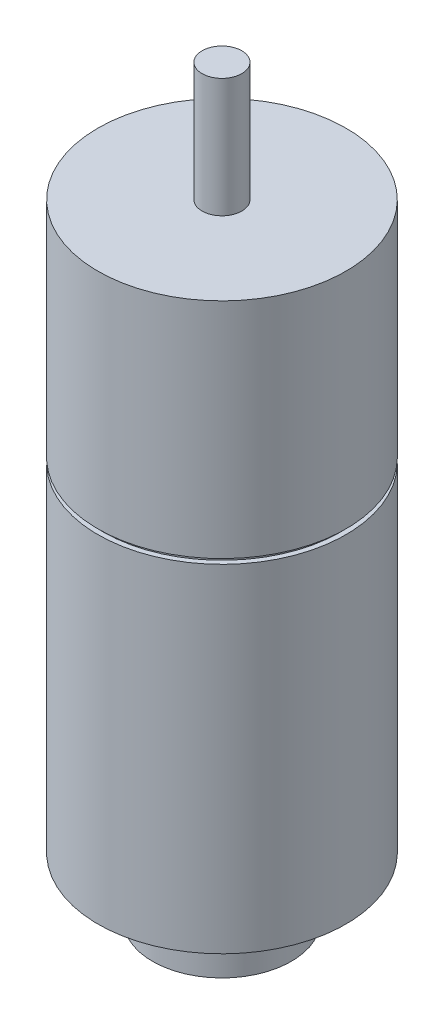
ISO-10303-21;
HEADER;
FILE_DESCRIPTION(('STEP AP214'),'2;1');
FILE_NAME('part.step','',(''),(''),'','','');
FILE_SCHEMA(('AUTOMOTIVE_DESIGN { 1 0 10303 214 1 1 1 1 }'));
ENDSEC;
DATA;
#1=APPLICATION_CONTEXT('core data for automotive mechanical design processes');
#2=APPLICATION_PROTOCOL_DEFINITION('international standard','automotive_design',2000,#1);
#3=PRODUCT_CONTEXT('',#1,'mechanical');
#4=PRODUCT('Part','Part','',(#3));
#5=PRODUCT_RELATED_PRODUCT_CATEGORY('part','',(#4));
#6=PRODUCT_DEFINITION_FORMATION('','',#4);
#7=PRODUCT_DEFINITION_CONTEXT('part definition',#1,'design');
#8=PRODUCT_DEFINITION('design','',#6,#7);
#9=PRODUCT_DEFINITION_SHAPE('','',#8);
#10=(LENGTH_UNIT() NAMED_UNIT(*) SI_UNIT(.MILLI.,.METRE.));
#11=(NAMED_UNIT(*) PLANE_ANGLE_UNIT() SI_UNIT($,.RADIAN.));
#12=(NAMED_UNIT(*) SI_UNIT($,.STERADIAN.) SOLID_ANGLE_UNIT());
#13=UNCERTAINTY_MEASURE_WITH_UNIT(LENGTH_MEASURE(1.E-05),#10,'distance_accuracy_value','');
#14=(GEOMETRIC_REPRESENTATION_CONTEXT(3) GLOBAL_UNCERTAINTY_ASSIGNED_CONTEXT((#13)) GLOBAL_UNIT_ASSIGNED_CONTEXT((#10,
#11,#12)) REPRESENTATION_CONTEXT('',''));
#15=CARTESIAN_POINT('',(0.,0.,0.));
#16=DIRECTION('',(0.,0.,1.));
#17=DIRECTION('',(1.,0.,0.));
#18=AXIS2_PLACEMENT_3D('',#15,#16,#17);
#19=CARTESIAN_POINT('',(0.,0.,0.));
#20=DIRECTION('',(0.,1.,0.));
#21=DIRECTION('',(-1.,0.,0.));
#22=AXIS2_PLACEMENT_3D('',#19,#20,#21);
#23=PLANE('',#22);
#24=CARTESIAN_POINT('',(0.,0.,0.));
#25=DIRECTION('',(0.,1.,0.));
#26=DIRECTION('',(-1.,0.,0.));
#27=AXIS2_PLACEMENT_3D('',#24,#25,#26);
#28=CIRCLE('',#27,7.00000000000001);
#29=CARTESIAN_POINT('',(-7.00000000000001,0.,0.));
#30=VERTEX_POINT('',#29);
#31=EDGE_CURVE('E10',#30,#30,#28,.T.);
#32=ORIENTED_EDGE('',*,*,#31,.F.);
#33=EDGE_LOOP('',(#32));
#34=FACE_BOUND('',#33,.T.);
#35=ADVANCED_FACE('F31',(#34),#23,.F.);
#36=CARTESIAN_POINT('',(0.,75.,0.));
#37=DIRECTION('',(0.,1.,0.));
#38=DIRECTION('',(-1.,0.,0.));
#39=AXIS2_PLACEMENT_3D('',#36,#37,#38);
#40=CYLINDRICAL_SURFACE('',#39,7.00000000000002);
#41=CARTESIAN_POINT('',(0.,5.,0.));
#42=DIRECTION('',(0.,1.,0.));
#43=DIRECTION('',(-1.,0.,0.));
#44=AXIS2_PLACEMENT_3D('',#41,#42,#43);
#45=CIRCLE('',#44,7.00000000000003);
#46=CARTESIAN_POINT('',(-7.00000000000003,5.,0.));
#47=VERTEX_POINT('',#46);
#48=EDGE_CURVE('E37',#47,#47,#45,.T.);
#49=ORIENTED_EDGE('',*,*,#48,.F.);
#50=EDGE_LOOP('',(#49));
#51=FACE_BOUND('',#50,.T.);
#52=ORIENTED_EDGE('',*,*,#31,.T.);
#53=EDGE_LOOP('',(#52));
#54=FACE_BOUND('',#53,.T.);
#55=ADVANCED_FACE('F133',(#51,#54),#40,.T.);
#56=CARTESIAN_POINT('',(7.00000000000003,5.,0.));
#57=DIRECTION('',(0.,-1.,0.));
#58=DIRECTION('',(1.,0.,0.));
#59=AXIS2_PLACEMENT_3D('',#56,#57,#58);
#60=PLANE('',#59);
#61=CARTESIAN_POINT('',(0.,5.,0.));
#62=DIRECTION('',(0.,1.,0.));
#63=DIRECTION('',(-1.,0.,0.));
#64=AXIS2_PLACEMENT_3D('',#61,#62,#63);
#65=CIRCLE('',#64,6.00000000000003);
#66=CARTESIAN_POINT('',(-6.00000000000003,5.,0.));
#67=VERTEX_POINT('',#66);
#68=EDGE_CURVE('E41',#67,#67,#65,.T.);
#69=ORIENTED_EDGE('',*,*,#68,.F.);
#70=EDGE_LOOP('',(#69));
#71=FACE_BOUND('',#70,.T.);
#72=ORIENTED_EDGE('',*,*,#48,.T.);
#73=EDGE_LOOP('',(#72));
#74=FACE_BOUND('',#73,.T.);
#75=ADVANCED_FACE('F128',(#71,#74),#60,.F.);
#76=CARTESIAN_POINT('',(0.,75.,0.));
#77=DIRECTION('',(0.,1.,0.));
#78=DIRECTION('',(-1.,0.,0.));
#79=AXIS2_PLACEMENT_3D('',#76,#77,#78);
#80=CYLINDRICAL_SURFACE('',#79,6.00000000000003);
#81=CARTESIAN_POINT('',(0.,5.99999999999999,0.));
#82=DIRECTION('',(0.,1.,0.));
#83=DIRECTION('',(-1.,0.,0.));
#84=AXIS2_PLACEMENT_3D('',#81,#82,#83);
#85=CIRCLE('',#84,6.00000000000003);
#86=CARTESIAN_POINT('',(-6.00000000000003,5.99999999999999,0.));
#87=VERTEX_POINT('',#86);
#88=EDGE_CURVE('E45',#87,#87,#85,.T.);
#89=ORIENTED_EDGE('',*,*,#88,.F.);
#90=EDGE_LOOP('',(#89));
#91=FACE_BOUND('',#90,.T.);
#92=ORIENTED_EDGE('',*,*,#68,.T.);
#93=EDGE_LOOP('',(#92));
#94=FACE_BOUND('',#93,.T.);
#95=ADVANCED_FACE('F122',(#91,#94),#80,.T.);
#96=CARTESIAN_POINT('',(6.00000000000003,6.,0.));
#97=DIRECTION('',(0.,1.,0.));
#98=DIRECTION('',(-1.,0.,0.));
#99=AXIS2_PLACEMENT_3D('',#96,#97,#98);
#100=PLANE('',#99);
#101=CARTESIAN_POINT('',(0.,5.99999999999999,0.));
#102=DIRECTION('',(0.,1.,0.));
#103=DIRECTION('',(-1.,0.,0.));
#104=AXIS2_PLACEMENT_3D('',#101,#102,#103);
#105=CIRCLE('',#104,12.5);
#106=CARTESIAN_POINT('',(-12.5,5.99999999999999,0.));
#107=VERTEX_POINT('',#106);
#108=EDGE_CURVE('E50',#107,#107,#105,.T.);
#109=ORIENTED_EDGE('',*,*,#108,.F.);
#110=EDGE_LOOP('',(#109));
#111=FACE_BOUND('',#110,.T.);
#112=ORIENTED_EDGE('',*,*,#88,.T.);
#113=EDGE_LOOP('',(#112));
#114=FACE_BOUND('',#113,.T.);
#115=ADVANCED_FACE('F116',(#111,#114),#100,.F.);
#116=CARTESIAN_POINT('',(0.,75.,0.));
#117=DIRECTION('',(0.,1.,0.));
#118=DIRECTION('',(-1.,0.,0.));
#119=AXIS2_PLACEMENT_3D('',#116,#117,#118);
#120=CYLINDRICAL_SURFACE('',#119,12.5);
#121=CARTESIAN_POINT('',(0.,40.,0.));
#122=DIRECTION('',(0.,1.,0.));
#123=DIRECTION('',(-1.,0.,0.));
#124=AXIS2_PLACEMENT_3D('',#121,#122,#123);
#125=CIRCLE('',#124,12.5);
#126=CARTESIAN_POINT('',(-12.5,40.,0.));
#127=VERTEX_POINT('',#126);
#128=EDGE_CURVE('E53',#127,#127,#125,.T.);
#129=ORIENTED_EDGE('',*,*,#128,.F.);
#130=EDGE_LOOP('',(#129));
#131=FACE_BOUND('',#130,.T.);
#132=ORIENTED_EDGE('',*,*,#108,.T.);
#133=EDGE_LOOP('',(#132));
#134=FACE_BOUND('',#133,.T.);
#135=ADVANCED_FACE('F110',(#131,#134),#120,.T.);
#136=CARTESIAN_POINT('',(12.5,40.,0.));
#137=DIRECTION('',(0.,-1.,0.));
#138=DIRECTION('',(1.,0.,0.));
#139=AXIS2_PLACEMENT_3D('',#136,#137,#138);
#140=PLANE('',#139);
#141=CARTESIAN_POINT('',(0.,40.,0.));
#142=DIRECTION('',(0.,1.,0.));
#143=DIRECTION('',(-1.,0.,0.));
#144=AXIS2_PLACEMENT_3D('',#141,#142,#143);
#145=CIRCLE('',#144,12.);
#146=CARTESIAN_POINT('',(-12.,40.,0.));
#147=VERTEX_POINT('',#146);
#148=EDGE_CURVE('E56',#147,#147,#145,.T.);
#149=ORIENTED_EDGE('',*,*,#148,.F.);
#150=EDGE_LOOP('',(#149));
#151=FACE_BOUND('',#150,.T.);
#152=ORIENTED_EDGE('',*,*,#128,.T.);
#153=EDGE_LOOP('',(#152));
#154=FACE_BOUND('',#153,.T.);
#155=ADVANCED_FACE('F104',(#151,#154),#140,.F.);
#156=CARTESIAN_POINT('',(0.,75.,0.));
#157=DIRECTION('',(0.,1.,0.));
#158=DIRECTION('',(-1.,0.,0.));
#159=AXIS2_PLACEMENT_3D('',#156,#157,#158);
#160=CYLINDRICAL_SURFACE('',#159,12.);
#161=CARTESIAN_POINT('',(0.,40.5,0.));
#162=DIRECTION('',(0.,1.,0.));
#163=DIRECTION('',(-1.,0.,0.));
#164=AXIS2_PLACEMENT_3D('',#161,#162,#163);
#165=CIRCLE('',#164,12.);
#166=CARTESIAN_POINT('',(-12.,40.5,0.));
#167=VERTEX_POINT('',#166);
#168=EDGE_CURVE('E59',#167,#167,#165,.T.);
#169=ORIENTED_EDGE('',*,*,#168,.F.);
#170=EDGE_LOOP('',(#169));
#171=FACE_BOUND('',#170,.T.);
#172=ORIENTED_EDGE('',*,*,#148,.T.);
#173=EDGE_LOOP('',(#172));
#174=FACE_BOUND('',#173,.T.);
#175=ADVANCED_FACE('F98',(#171,#174),#160,.T.);
#176=CARTESIAN_POINT('',(12.,40.5,0.));
#177=DIRECTION('',(0.,1.,0.));
#178=DIRECTION('',(-1.,0.,0.));
#179=AXIS2_PLACEMENT_3D('',#176,#177,#178);
#180=PLANE('',#179);
#181=CARTESIAN_POINT('',(0.,40.5,0.));
#182=DIRECTION('',(0.,1.,0.));
#183=DIRECTION('',(-1.,0.,0.));
#184=AXIS2_PLACEMENT_3D('',#181,#182,#183);
#185=CIRCLE('',#184,12.5);
#186=CARTESIAN_POINT('',(-12.5,40.5,0.));
#187=VERTEX_POINT('',#186);
#188=EDGE_CURVE('E62',#187,#187,#185,.T.);
#189=ORIENTED_EDGE('',*,*,#188,.F.);
#190=EDGE_LOOP('',(#189));
#191=FACE_BOUND('',#190,.T.);
#192=ORIENTED_EDGE('',*,*,#168,.T.);
#193=EDGE_LOOP('',(#192));
#194=FACE_BOUND('',#193,.T.);
#195=ADVANCED_FACE('F92',(#191,#194),#180,.F.);
#196=CARTESIAN_POINT('',(0.,75.,0.));
#197=DIRECTION('',(0.,1.,0.));
#198=DIRECTION('',(-1.,0.,0.));
#199=AXIS2_PLACEMENT_3D('',#196,#197,#198);
#200=CYLINDRICAL_SURFACE('',#199,12.5);
#201=CARTESIAN_POINT('',(0.,63.,0.));
#202=DIRECTION('',(0.,1.,0.));
#203=DIRECTION('',(-1.,0.,0.));
#204=AXIS2_PLACEMENT_3D('',#201,#202,#203);
#205=CIRCLE('',#204,12.5);
#206=CARTESIAN_POINT('',(-12.5,63.,0.));
#207=VERTEX_POINT('',#206);
#208=EDGE_CURVE('E65',#207,#207,#205,.T.);
#209=ORIENTED_EDGE('',*,*,#208,.F.);
#210=EDGE_LOOP('',(#209));
#211=FACE_BOUND('',#210,.T.);
#212=ORIENTED_EDGE('',*,*,#188,.T.);
#213=EDGE_LOOP('',(#212));
#214=FACE_BOUND('',#213,.T.);
#215=ADVANCED_FACE('F86',(#211,#214),#200,.T.);
#216=CARTESIAN_POINT('',(12.5,63.,0.));
#217=DIRECTION('',(0.,-1.,0.));
#218=DIRECTION('',(1.,0.,0.));
#219=AXIS2_PLACEMENT_3D('',#216,#217,#218);
#220=PLANE('',#219);
#221=CARTESIAN_POINT('',(0.,63.,0.));
#222=DIRECTION('',(0.,1.,0.));
#223=DIRECTION('',(-1.,0.,0.));
#224=AXIS2_PLACEMENT_3D('',#221,#222,#223);
#225=CIRCLE('',#224,2.);
#226=CARTESIAN_POINT('',(-2.00000000000001,63.,0.));
#227=VERTEX_POINT('',#226);
#228=EDGE_CURVE('E68',#227,#227,#225,.T.);
#229=ORIENTED_EDGE('',*,*,#228,.F.);
#230=EDGE_LOOP('',(#229));
#231=FACE_BOUND('',#230,.T.);
#232=ORIENTED_EDGE('',*,*,#208,.T.);
#233=EDGE_LOOP('',(#232));
#234=FACE_BOUND('',#233,.T.);
#235=ADVANCED_FACE('F80',(#231,#234),#220,.F.);
#236=CARTESIAN_POINT('',(0.,75.,0.));
#237=DIRECTION('',(0.,1.,0.));
#238=DIRECTION('',(-1.,0.,0.));
#239=AXIS2_PLACEMENT_3D('',#236,#237,#238);
#240=CYLINDRICAL_SURFACE('',#239,2.);
#241=CARTESIAN_POINT('',(0.,75.,0.));
#242=DIRECTION('',(0.,1.,0.));
#243=DIRECTION('',(-1.,0.,0.));
#244=AXIS2_PLACEMENT_3D('',#241,#242,#243);
#245=CIRCLE('',#244,2.);
#246=CARTESIAN_POINT('',(-2.,75.,0.));
#247=VERTEX_POINT('',#246);
#248=EDGE_CURVE('E71',#247,#247,#245,.T.);
#249=ORIENTED_EDGE('',*,*,#248,.F.);
#250=EDGE_LOOP('',(#249));
#251=FACE_BOUND('',#250,.T.);
#252=ORIENTED_EDGE('',*,*,#228,.T.);
#253=EDGE_LOOP('',(#252));
#254=FACE_BOUND('',#253,.T.);
#255=ADVANCED_FACE('F77',(#251,#254),#240,.T.);
#256=CARTESIAN_POINT('',(2.,75.,0.));
#257=DIRECTION('',(0.,-1.,0.));
#258=DIRECTION('',(1.,0.,0.));
#259=AXIS2_PLACEMENT_3D('',#256,#257,#258);
#260=PLANE('',#259);
#261=ORIENTED_EDGE('',*,*,#248,.T.);
#262=EDGE_LOOP('',(#261));
#263=FACE_BOUND('',#262,.T.);
#264=ADVANCED_FACE('F75',(#263),#260,.F.);
#265=CLOSED_SHELL('',(#35,#55,#75,#95,#115,#135,#155,#175,#195,#215,#235,#255,#264));
#266=MANIFOLD_SOLID_BREP('B2',#265);
#267=ADVANCED_BREP_SHAPE_REPRESENTATION('',(#18,#266),#14);
#268=SHAPE_DEFINITION_REPRESENTATION(#9,#267);
ENDSEC;
END-ISO-10303-21;
